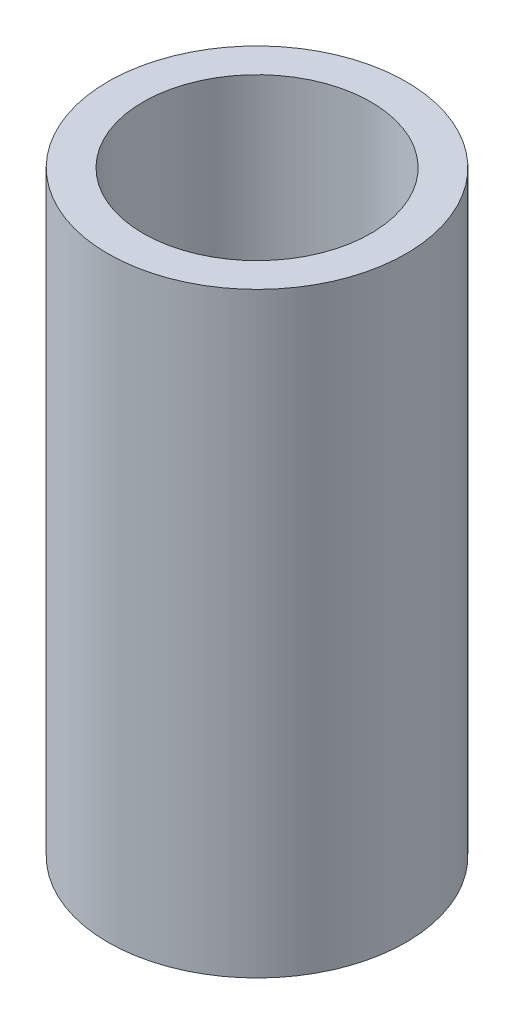
ISO-10303-21;
HEADER;
FILE_DESCRIPTION(('STEP AP214'),'2;1');
FILE_NAME('part.step','',(''),(''),'','','');
FILE_SCHEMA(('AUTOMOTIVE_DESIGN { 1 0 10303 214 1 1 1 1 }'));
ENDSEC;
DATA;
#1=APPLICATION_CONTEXT('core data for automotive mechanical design processes');
#2=APPLICATION_PROTOCOL_DEFINITION('international standard','automotive_design',2000,#1);
#3=PRODUCT_CONTEXT('',#1,'mechanical');
#4=PRODUCT('Part','Part','',(#3));
#5=PRODUCT_RELATED_PRODUCT_CATEGORY('part','',(#4));
#6=PRODUCT_DEFINITION_FORMATION('','',#4);
#7=PRODUCT_DEFINITION_CONTEXT('part definition',#1,'design');
#8=PRODUCT_DEFINITION('design','',#6,#7);
#9=PRODUCT_DEFINITION_SHAPE('','',#8);
#10=(LENGTH_UNIT() NAMED_UNIT(*) SI_UNIT(.MILLI.,.METRE.));
#11=(NAMED_UNIT(*) PLANE_ANGLE_UNIT() SI_UNIT($,.RADIAN.));
#12=(NAMED_UNIT(*) SI_UNIT($,.STERADIAN.) SOLID_ANGLE_UNIT());
#13=UNCERTAINTY_MEASURE_WITH_UNIT(LENGTH_MEASURE(1.E-05),#10,'distance_accuracy_value','');
#14=(GEOMETRIC_REPRESENTATION_CONTEXT(3) GLOBAL_UNCERTAINTY_ASSIGNED_CONTEXT((#13)) GLOBAL_UNIT_ASSIGNED_CONTEXT((#10,
#11,#12)) REPRESENTATION_CONTEXT('',''));
#15=CARTESIAN_POINT('',(0.,0.,0.));
#16=DIRECTION('',(0.,0.,1.));
#17=DIRECTION('',(1.,0.,0.));
#18=AXIS2_PLACEMENT_3D('',#15,#16,#17);
#19=CARTESIAN_POINT('',(0.,114.3,0.));
#20=DIRECTION('',(0.,1.,0.));
#21=DIRECTION('',(0.,0.,1.));
#22=AXIS2_PLACEMENT_3D('',#19,#20,#21);
#23=PLANE('',#22);
#24=CARTESIAN_POINT('',(0.,114.3,0.));
#25=DIRECTION('',(0.,1.,0.));
#26=DIRECTION('',(0.,0.,1.));
#27=AXIS2_PLACEMENT_3D('',#24,#25,#26);
#28=CIRCLE('',#27,57.15);
#29=CARTESIAN_POINT('',(0.,114.3,57.15));
#30=VERTEX_POINT('',#29);
#31=EDGE_CURVE('E10',#30,#30,#28,.T.);
#32=ORIENTED_EDGE('',*,*,#31,.T.);
#33=EDGE_LOOP('',(#32));
#34=FACE_BOUND('',#33,.T.);
#35=CARTESIAN_POINT('',(0.,114.3,0.));
#36=DIRECTION('',(0.,1.,0.));
#37=DIRECTION('',(0.,0.,1.));
#38=AXIS2_PLACEMENT_3D('',#35,#36,#37);
#39=CIRCLE('',#38,43.6626);
#40=CARTESIAN_POINT('',(0.,114.3,43.6626));
#41=VERTEX_POINT('',#40);
#42=EDGE_CURVE('E40',#41,#41,#39,.T.);
#43=ORIENTED_EDGE('',*,*,#42,.F.);
#44=EDGE_LOOP('',(#43));
#45=FACE_BOUND('',#44,.T.);
#46=ADVANCED_FACE('F29',(#34,#45),#23,.T.);
#47=CARTESIAN_POINT('',(0.,-114.3,0.));
#48=DIRECTION('',(0.,1.,0.));
#49=DIRECTION('',(0.,0.,1.));
#50=AXIS2_PLACEMENT_3D('',#47,#48,#49);
#51=PLANE('',#50);
#52=CARTESIAN_POINT('',(0.,-114.3,0.));
#53=DIRECTION('',(0.,1.,0.));
#54=DIRECTION('',(0.,0.,1.));
#55=AXIS2_PLACEMENT_3D('',#52,#53,#54);
#56=CIRCLE('',#55,57.15);
#57=CARTESIAN_POINT('',(0.,-114.3,57.15));
#58=VERTEX_POINT('',#57);
#59=EDGE_CURVE('E33',#58,#58,#56,.T.);
#60=ORIENTED_EDGE('',*,*,#59,.F.);
#61=EDGE_LOOP('',(#60));
#62=FACE_BOUND('',#61,.T.);
#63=CARTESIAN_POINT('',(0.,-114.3,0.));
#64=DIRECTION('',(0.,1.,0.));
#65=DIRECTION('',(0.,0.,1.));
#66=AXIS2_PLACEMENT_3D('',#63,#64,#65);
#67=CIRCLE('',#66,43.6626);
#68=CARTESIAN_POINT('',(0.,-114.3,43.6626));
#69=VERTEX_POINT('',#68);
#70=EDGE_CURVE('E42',#69,#69,#67,.T.);
#71=ORIENTED_EDGE('',*,*,#70,.T.);
#72=EDGE_LOOP('',(#71));
#73=FACE_BOUND('',#72,.T.);
#74=ADVANCED_FACE('F52',(#62,#73),#51,.F.);
#75=CARTESIAN_POINT('',(0.,114.3,0.));
#76=DIRECTION('',(0.,-1.,0.));
#77=DIRECTION('',(0.,0.,-1.));
#78=AXIS2_PLACEMENT_3D('',#75,#76,#77);
#79=CYLINDRICAL_SURFACE('',#78,57.15);
#80=ORIENTED_EDGE('',*,*,#31,.F.);
#81=EDGE_LOOP('',(#80));
#82=FACE_BOUND('',#81,.T.);
#83=ORIENTED_EDGE('',*,*,#59,.T.);
#84=EDGE_LOOP('',(#83));
#85=FACE_BOUND('',#84,.T.);
#86=ADVANCED_FACE('F31',(#82,#85),#79,.T.);
#87=CARTESIAN_POINT('',(0.,114.3,0.));
#88=DIRECTION('',(0.,-1.,0.));
#89=DIRECTION('',(0.,0.,-1.));
#90=AXIS2_PLACEMENT_3D('',#87,#88,#89);
#91=CYLINDRICAL_SURFACE('',#90,43.6626);
#92=ORIENTED_EDGE('',*,*,#42,.T.);
#93=EDGE_LOOP('',(#92));
#94=FACE_BOUND('',#93,.T.);
#95=ORIENTED_EDGE('',*,*,#70,.F.);
#96=EDGE_LOOP('',(#95));
#97=FACE_BOUND('',#96,.T.);
#98=ADVANCED_FACE('F48',(#94,#97),#91,.F.);
#99=CLOSED_SHELL('',(#46,#74,#86,#98));
#100=MANIFOLD_SOLID_BREP('B2',#99);
#101=ADVANCED_BREP_SHAPE_REPRESENTATION('',(#18,#100),#14);
#102=SHAPE_DEFINITION_REPRESENTATION(#9,#101);
ENDSEC;
END-ISO-10303-21;
